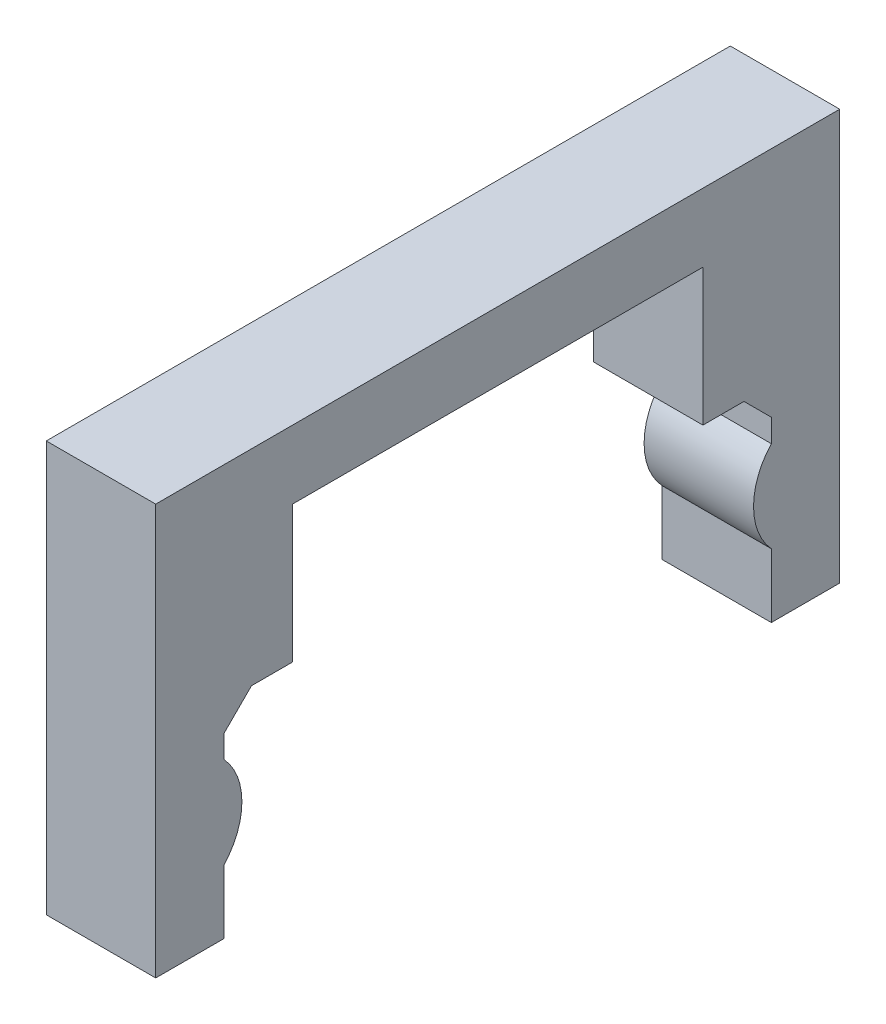
ISO-10303-21;
HEADER;
FILE_DESCRIPTION(('STEP AP214'),'2;1');
FILE_NAME('part.step','',(''),(''),'','','');
FILE_SCHEMA(('AUTOMOTIVE_DESIGN { 1 0 10303 214 1 1 1 1 }'));
ENDSEC;
DATA;
#1=APPLICATION_CONTEXT('core data for automotive mechanical design processes');
#2=APPLICATION_PROTOCOL_DEFINITION('international standard','automotive_design',2000,#1);
#3=PRODUCT_CONTEXT('',#1,'mechanical');
#4=PRODUCT('Part','Part','',(#3));
#5=PRODUCT_RELATED_PRODUCT_CATEGORY('part','',(#4));
#6=PRODUCT_DEFINITION_FORMATION('','',#4);
#7=PRODUCT_DEFINITION_CONTEXT('part definition',#1,'design');
#8=PRODUCT_DEFINITION('design','',#6,#7);
#9=PRODUCT_DEFINITION_SHAPE('','',#8);
#10=(LENGTH_UNIT() NAMED_UNIT(*) SI_UNIT(.MILLI.,.METRE.));
#11=(NAMED_UNIT(*) PLANE_ANGLE_UNIT() SI_UNIT($,.RADIAN.));
#12=(NAMED_UNIT(*) SI_UNIT($,.STERADIAN.) SOLID_ANGLE_UNIT());
#13=UNCERTAINTY_MEASURE_WITH_UNIT(LENGTH_MEASURE(1.E-05),#10,'distance_accuracy_value','');
#14=(GEOMETRIC_REPRESENTATION_CONTEXT(3) GLOBAL_UNCERTAINTY_ASSIGNED_CONTEXT((#13)) GLOBAL_UNIT_ASSIGNED_CONTEXT((#10,
#11,#12)) REPRESENTATION_CONTEXT('',''));
#15=CARTESIAN_POINT('',(0.,0.,0.));
#16=DIRECTION('',(0.,0.,1.));
#17=DIRECTION('',(1.,0.,0.));
#18=AXIS2_PLACEMENT_3D('',#15,#16,#17);
#19=CARTESIAN_POINT('',(10.16,9.94734725305141,44.6955776659082));
#20=DIRECTION('',(0.,0.,-1.));
#21=DIRECTION('',(-1.,0.,0.));
#22=AXIS2_PLACEMENT_3D('',#19,#20,#21);
#23=PLANE('',#22);
#24=DIRECTION('',(0.,-1.,0.));
#25=VECTOR('',#24,1.);
#26=CARTESIAN_POINT('',(10.16,9.94734725305141,44.6955776659082));
#27=LINE('',#26,#25);
#28=CARTESIAN_POINT('',(10.16,7.4073472530514,44.6955776659082));
#29=VERTEX_POINT('',#28);
#30=CARTESIAN_POINT('',(10.16,5.27902286825445,44.6955776659082));
#31=VERTEX_POINT('',#30);
#32=EDGE_CURVE('E156',#29,#31,#27,.T.);
#33=ORIENTED_EDGE('',*,*,#32,.F.);
#34=DIRECTION('',(-1.,0.,0.));
#35=VECTOR('',#34,1.);
#36=CARTESIAN_POINT('',(0.,7.4073472530514,44.6955776659082));
#37=LINE('',#36,#35);
#38=CARTESIAN_POINT('',(0.,7.4073472530514,44.6955776659082));
#39=VERTEX_POINT('',#38);
#40=EDGE_CURVE('E277',#29,#39,#37,.T.);
#41=ORIENTED_EDGE('',*,*,#40,.T.);
#42=DIRECTION('',(0.,-1.,0.));
#43=VECTOR('',#42,1.);
#44=CARTESIAN_POINT('',(0.,9.94734725305141,44.6955776659082));
#45=LINE('',#44,#43);
#46=CARTESIAN_POINT('',(0.,5.27902286825445,44.6955776659082));
#47=VERTEX_POINT('',#46);
#48=EDGE_CURVE('E179',#39,#47,#45,.T.);
#49=ORIENTED_EDGE('',*,*,#48,.T.);
#50=DIRECTION('',(1.,0.,0.));
#51=VECTOR('',#50,1.);
#52=CARTESIAN_POINT('',(0.,5.27902286825445,44.6955776659082));
#53=LINE('',#52,#51);
#54=EDGE_CURVE('E172',#47,#31,#53,.T.);
#55=ORIENTED_EDGE('',*,*,#54,.T.);
#56=EDGE_LOOP('',(#33,#41,#49,#55));
#57=FACE_BOUND('',#56,.T.);
#58=ADVANCED_FACE('F32',(#57),#23,.F.);
#59=CARTESIAN_POINT('',(10.16,-9.1026527469486,95.4955776659082));
#60=DIRECTION('',(0.,0.,1.));
#61=DIRECTION('',(1.,0.,0.));
#62=AXIS2_PLACEMENT_3D('',#59,#60,#61);
#63=PLANE('',#62);
#64=DIRECTION('',(0.,1.,0.));
#65=VECTOR('',#64,1.);
#66=CARTESIAN_POINT('',(0.,-9.1026527469486,95.4955776659082));
#67=LINE('',#66,#65);
#68=CARTESIAN_POINT('',(0.,-9.1026527469486,95.4955776659082));
#69=VERTEX_POINT('',#68);
#70=CARTESIAN_POINT('',(0.,-3.16432836215164,95.4955776659082));
#71=VERTEX_POINT('',#70);
#72=EDGE_CURVE('E223',#69,#71,#67,.T.);
#73=ORIENTED_EDGE('',*,*,#72,.T.);
#74=DIRECTION('',(1.,0.,0.));
#75=VECTOR('',#74,1.);
#76=CARTESIAN_POINT('',(0.,-3.16432836215164,95.4955776659082));
#77=LINE('',#76,#75);
#78=CARTESIAN_POINT('',(10.16,-3.16432836215164,95.4955776659082));
#79=VERTEX_POINT('',#78);
#80=EDGE_CURVE('E190',#71,#79,#77,.T.);
#81=ORIENTED_EDGE('',*,*,#80,.T.);
#82=DIRECTION('',(0.,1.,0.));
#83=VECTOR('',#82,1.);
#84=CARTESIAN_POINT('',(10.16,-9.1026527469486,95.4955776659082));
#85=LINE('',#84,#83);
#86=CARTESIAN_POINT('',(10.16,-9.1026527469486,95.4955776659082));
#87=VERTEX_POINT('',#86);
#88=EDGE_CURVE('E200',#87,#79,#85,.T.);
#89=ORIENTED_EDGE('',*,*,#88,.F.);
#90=DIRECTION('',(-1.,0.,0.));
#91=VECTOR('',#90,1.);
#92=CARTESIAN_POINT('',(10.16,-9.1026527469486,95.4955776659082));
#93=LINE('',#92,#91);
#94=EDGE_CURVE('E266',#87,#69,#93,.T.);
#95=ORIENTED_EDGE('',*,*,#94,.T.);
#96=EDGE_LOOP('',(#73,#81,#89,#95));
#97=FACE_BOUND('',#96,.T.);
#98=ADVANCED_FACE('F310',(#97),#63,.F.);
#99=CARTESIAN_POINT('',(10.16,28.9973472530514,101.845577665908));
#100=DIRECTION('',(0.,0.,-1.));
#101=DIRECTION('',(-1.,0.,0.));
#102=AXIS2_PLACEMENT_3D('',#99,#100,#101);
#103=PLANE('',#102);
#104=DIRECTION('',(-1.,0.,0.));
#105=VECTOR('',#104,1.);
#106=CARTESIAN_POINT('',(10.16,-9.1026527469486,101.845577665908));
#107=LINE('',#106,#105);
#108=CARTESIAN_POINT('',(10.16,-9.1026527469486,101.845577665908));
#109=VERTEX_POINT('',#108);
#110=CARTESIAN_POINT('',(0.,-9.1026527469486,101.845577665908));
#111=VERTEX_POINT('',#110);
#112=EDGE_CURVE('E269',#109,#111,#107,.T.);
#113=ORIENTED_EDGE('',*,*,#112,.F.);
#114=DIRECTION('',(0.,-1.,0.));
#115=VECTOR('',#114,1.);
#116=CARTESIAN_POINT('',(10.16,28.9973472530514,101.845577665908));
#117=LINE('',#116,#115);
#118=CARTESIAN_POINT('',(10.16,28.9973472530514,101.845577665908));
#119=VERTEX_POINT('',#118);
#120=EDGE_CURVE('E194',#119,#109,#117,.T.);
#121=ORIENTED_EDGE('',*,*,#120,.F.);
#122=DIRECTION('',(-1.,0.,0.));
#123=VECTOR('',#122,1.);
#124=CARTESIAN_POINT('',(10.16,28.9973472530514,101.845577665908));
#125=LINE('',#124,#123);
#126=CARTESIAN_POINT('',(0.,28.9973472530514,101.845577665908));
#127=VERTEX_POINT('',#126);
#128=EDGE_CURVE('E218',#119,#127,#125,.T.);
#129=ORIENTED_EDGE('',*,*,#128,.T.);
#130=DIRECTION('',(0.,-1.,0.));
#131=VECTOR('',#130,1.);
#132=CARTESIAN_POINT('',(0.,28.9973472530514,101.845577665908));
#133=LINE('',#132,#131);
#134=EDGE_CURVE('E193',#127,#111,#133,.T.);
#135=ORIENTED_EDGE('',*,*,#134,.T.);
#136=EDGE_LOOP('',(#113,#121,#129,#135));
#137=FACE_BOUND('',#136,.T.);
#138=ADVANCED_FACE('F321',(#137),#103,.F.);
#139=CARTESIAN_POINT('',(10.16,-9.1026527469486,101.845577665908));
#140=DIRECTION('',(0.,1.,0.));
#141=DIRECTION('',(0.,0.,1.));
#142=AXIS2_PLACEMENT_3D('',#139,#140,#141);
#143=PLANE('',#142);
#144=DIRECTION('',(0.,0.,-1.));
#145=VECTOR('',#144,1.);
#146=CARTESIAN_POINT('',(0.,-9.1026527469486,101.845577665908));
#147=LINE('',#146,#145);
#148=EDGE_CURVE('E220',#111,#69,#147,.T.);
#149=ORIENTED_EDGE('',*,*,#148,.T.);
#150=ORIENTED_EDGE('',*,*,#94,.F.);
#151=DIRECTION('',(0.,0.,-1.));
#152=VECTOR('',#151,1.);
#153=CARTESIAN_POINT('',(10.16,-9.1026527469486,101.845577665908));
#154=LINE('',#153,#152);
#155=EDGE_CURVE('E196',#109,#87,#154,.T.);
#156=ORIENTED_EDGE('',*,*,#155,.F.);
#157=ORIENTED_EDGE('',*,*,#112,.T.);
#158=EDGE_LOOP('',(#149,#150,#156,#157));
#159=FACE_BOUND('',#158,.T.);
#160=ADVANCED_FACE('F315',(#159),#143,.F.);
#161=CARTESIAN_POINT('',(0.,5.27902286825446,95.4955776659082));
#162=VERTEX_POINT('',#161);
#163=CARTESIAN_POINT('',(0.,7.4073472530514,95.4955776659082));
#164=VERTEX_POINT('',#163);
#165=EDGE_CURVE('E222',#162,#164,#67,.T.);
#166=ORIENTED_EDGE('',*,*,#165,.T.);
#167=DIRECTION('',(1.,0.,0.));
#168=VECTOR('',#167,1.);
#169=CARTESIAN_POINT('',(10.16,7.4073472530514,95.4955776659082));
#170=LINE('',#169,#168);
#171=CARTESIAN_POINT('',(10.16,7.4073472530514,95.4955776659082));
#172=VERTEX_POINT('',#171);
#173=EDGE_CURVE('E275',#164,#172,#170,.T.);
#174=ORIENTED_EDGE('',*,*,#173,.T.);
#175=CARTESIAN_POINT('',(10.16,5.27902286825446,95.4955776659082));
#176=VERTEX_POINT('',#175);
#177=EDGE_CURVE('E199',#176,#172,#85,.T.);
#178=ORIENTED_EDGE('',*,*,#177,.F.);
#179=DIRECTION('',(1.,0.,0.));
#180=VECTOR('',#179,1.);
#181=CARTESIAN_POINT('',(0.,5.27902286825446,95.4955776659082));
#182=LINE('',#181,#180);
#183=EDGE_CURVE('E186',#176,#162,#182,.F.);
#184=ORIENTED_EDGE('',*,*,#183,.T.);
#185=EDGE_LOOP('',(#166,#174,#178,#184));
#186=FACE_BOUND('',#185,.T.);
#187=ADVANCED_FACE('F303',(#186),#63,.F.);
#188=CARTESIAN_POINT('',(10.16,9.94734725305141,95.4955776659082));
#189=DIRECTION('',(0.,1.,0.));
#190=DIRECTION('',(0.,0.,1.));
#191=AXIS2_PLACEMENT_3D('',#188,#189,#190);
#192=PLANE('',#191);
#193=DIRECTION('',(0.,0.,-1.));
#194=VECTOR('',#193,1.);
#195=CARTESIAN_POINT('',(10.16,9.94734725305141,95.4955776659082));
#196=LINE('',#195,#194);
#197=CARTESIAN_POINT('',(10.16,9.94734725305141,92.9555776659082));
#198=VERTEX_POINT('',#197);
#199=CARTESIAN_POINT('',(10.16,9.94734725305141,89.1455776659082));
#200=VERTEX_POINT('',#199);
#201=EDGE_CURVE('E203',#198,#200,#196,.T.);
#202=ORIENTED_EDGE('',*,*,#201,.F.);
#203=DIRECTION('',(-1.,0.,0.));
#204=VECTOR('',#203,1.);
#205=CARTESIAN_POINT('',(0.,9.94734725305141,92.9555776659082));
#206=LINE('',#205,#204);
#207=CARTESIAN_POINT('',(0.,9.94734725305141,92.9555776659082));
#208=VERTEX_POINT('',#207);
#209=EDGE_CURVE('E272',#198,#208,#206,.T.);
#210=ORIENTED_EDGE('',*,*,#209,.T.);
#211=DIRECTION('',(0.,0.,-1.));
#212=VECTOR('',#211,1.);
#213=CARTESIAN_POINT('',(0.,9.94734725305141,95.4955776659082));
#214=LINE('',#213,#212);
#215=CARTESIAN_POINT('',(0.,9.94734725305141,89.1455776659082));
#216=VERTEX_POINT('',#215);
#217=EDGE_CURVE('E226',#208,#216,#214,.T.);
#218=ORIENTED_EDGE('',*,*,#217,.T.);
#219=DIRECTION('',(-1.,0.,0.));
#220=VECTOR('',#219,1.);
#221=CARTESIAN_POINT('',(10.16,9.94734725305141,89.1455776659082));
#222=LINE('',#221,#220);
#223=EDGE_CURVE('E263',#200,#216,#222,.T.);
#224=ORIENTED_EDGE('',*,*,#223,.F.);
#225=EDGE_LOOP('',(#202,#210,#218,#224));
#226=FACE_BOUND('',#225,.T.);
#227=ADVANCED_FACE('F292',(#226),#192,.F.);
#228=CARTESIAN_POINT('',(10.16,9.94734725305141,89.1455776659082));
#229=DIRECTION('',(0.,0.,1.));
#230=DIRECTION('',(1.,0.,0.));
#231=AXIS2_PLACEMENT_3D('',#228,#229,#230);
#232=PLANE('',#231);
#233=DIRECTION('',(0.,1.,0.));
#234=VECTOR('',#233,1.);
#235=CARTESIAN_POINT('',(0.,9.94734725305141,89.1455776659082));
#236=LINE('',#235,#234);
#237=CARTESIAN_POINT('',(0.,22.6473472530514,89.1455776659082));
#238=VERTEX_POINT('',#237);
#239=EDGE_CURVE('E228',#216,#238,#236,.T.);
#240=ORIENTED_EDGE('',*,*,#239,.T.);
#241=DIRECTION('',(-1.,0.,0.));
#242=VECTOR('',#241,1.);
#243=CARTESIAN_POINT('',(10.16,22.6473472530514,89.1455776659082));
#244=LINE('',#243,#242);
#245=CARTESIAN_POINT('',(10.16,22.6473472530514,89.1455776659082));
#246=VERTEX_POINT('',#245);
#247=EDGE_CURVE('E260',#246,#238,#244,.T.);
#248=ORIENTED_EDGE('',*,*,#247,.F.);
#249=DIRECTION('',(0.,1.,0.));
#250=VECTOR('',#249,1.);
#251=CARTESIAN_POINT('',(10.16,9.94734725305141,89.1455776659082));
#252=LINE('',#251,#250);
#253=EDGE_CURVE('E205',#200,#246,#252,.T.);
#254=ORIENTED_EDGE('',*,*,#253,.F.);
#255=ORIENTED_EDGE('',*,*,#223,.T.);
#256=EDGE_LOOP('',(#240,#248,#254,#255));
#257=FACE_BOUND('',#256,.T.);
#258=ADVANCED_FACE('F365',(#257),#232,.F.);
#259=CARTESIAN_POINT('',(10.16,22.6473472530514,89.1455776659082));
#260=DIRECTION('',(0.,1.,0.));
#261=DIRECTION('',(0.,0.,1.));
#262=AXIS2_PLACEMENT_3D('',#259,#260,#261);
#263=PLANE('',#262);
#264=DIRECTION('',(0.,0.,-1.));
#265=VECTOR('',#264,1.);
#266=CARTESIAN_POINT('',(0.,22.6473472530514,89.1455776659082));
#267=LINE('',#266,#265);
#268=CARTESIAN_POINT('',(0.,22.6473472530514,51.0455776659082));
#269=VERTEX_POINT('',#268);
#270=EDGE_CURVE('E230',#238,#269,#267,.T.);
#271=ORIENTED_EDGE('',*,*,#270,.T.);
#272=DIRECTION('',(-1.,0.,0.));
#273=VECTOR('',#272,1.);
#274=CARTESIAN_POINT('',(10.16,22.6473472530514,51.0455776659082));
#275=LINE('',#274,#273);
#276=CARTESIAN_POINT('',(10.16,22.6473472530514,51.0455776659082));
#277=VERTEX_POINT('',#276);
#278=EDGE_CURVE('E257',#277,#269,#275,.T.);
#279=ORIENTED_EDGE('',*,*,#278,.F.);
#280=DIRECTION('',(0.,0.,-1.));
#281=VECTOR('',#280,1.);
#282=CARTESIAN_POINT('',(10.16,22.6473472530514,89.1455776659082));
#283=LINE('',#282,#281);
#284=EDGE_CURVE('E207',#246,#277,#283,.T.);
#285=ORIENTED_EDGE('',*,*,#284,.F.);
#286=ORIENTED_EDGE('',*,*,#247,.T.);
#287=EDGE_LOOP('',(#271,#279,#285,#286));
#288=FACE_BOUND('',#287,.T.);
#289=ADVANCED_FACE('F447',(#288),#263,.F.);
#290=CARTESIAN_POINT('',(10.16,22.6473472530514,51.0455776659082));
#291=DIRECTION('',(0.,0.,-1.));
#292=DIRECTION('',(-1.,0.,0.));
#293=AXIS2_PLACEMENT_3D('',#290,#291,#292);
#294=PLANE('',#293);
#295=DIRECTION('',(0.,-1.,0.));
#296=VECTOR('',#295,1.);
#297=CARTESIAN_POINT('',(0.,22.6473472530514,51.0455776659082));
#298=LINE('',#297,#296);
#299=CARTESIAN_POINT('',(0.,9.94734725305141,51.0455776659082));
#300=VERTEX_POINT('',#299);
#301=EDGE_CURVE('E232',#269,#300,#298,.T.);
#302=ORIENTED_EDGE('',*,*,#301,.T.);
#303=DIRECTION('',(-1.,0.,0.));
#304=VECTOR('',#303,1.);
#305=CARTESIAN_POINT('',(10.16,9.94734725305141,51.0455776659082));
#306=LINE('',#305,#304);
#307=CARTESIAN_POINT('',(10.16,9.94734725305141,51.0455776659082));
#308=VERTEX_POINT('',#307);
#309=EDGE_CURVE('E254',#308,#300,#306,.T.);
#310=ORIENTED_EDGE('',*,*,#309,.F.);
#311=DIRECTION('',(0.,-1.,0.));
#312=VECTOR('',#311,1.);
#313=CARTESIAN_POINT('',(10.16,22.6473472530514,51.0455776659082));
#314=LINE('',#313,#312);
#315=EDGE_CURVE('E209',#277,#308,#314,.T.);
#316=ORIENTED_EDGE('',*,*,#315,.F.);
#317=ORIENTED_EDGE('',*,*,#278,.T.);
#318=EDGE_LOOP('',(#302,#310,#316,#317));
#319=FACE_BOUND('',#318,.T.);
#320=ADVANCED_FACE('F347',(#319),#294,.F.);
#321=CARTESIAN_POINT('',(10.16,9.94734725305141,51.0455776659082));
#322=DIRECTION('',(0.,1.,0.));
#323=DIRECTION('',(0.,0.,1.));
#324=AXIS2_PLACEMENT_3D('',#321,#322,#323);
#325=PLANE('',#324);
#326=DIRECTION('',(0.,0.,-1.));
#327=VECTOR('',#326,1.);
#328=CARTESIAN_POINT('',(0.,9.94734725305141,51.0455776659082));
#329=LINE('',#328,#327);
#330=CARTESIAN_POINT('',(0.,9.94734725305141,47.2355776659082));
#331=VERTEX_POINT('',#330);
#332=EDGE_CURVE('E234',#300,#331,#329,.T.);
#333=ORIENTED_EDGE('',*,*,#332,.T.);
#334=DIRECTION('',(1.,0.,0.));
#335=VECTOR('',#334,1.);
#336=CARTESIAN_POINT('',(10.16,9.94734725305141,47.2355776659082));
#337=LINE('',#336,#335);
#338=CARTESIAN_POINT('',(10.16,9.94734725305141,47.2355776659082));
#339=VERTEX_POINT('',#338);
#340=EDGE_CURVE('E47',#331,#339,#337,.T.);
#341=ORIENTED_EDGE('',*,*,#340,.T.);
#342=DIRECTION('',(0.,0.,-1.));
#343=VECTOR('',#342,1.);
#344=CARTESIAN_POINT('',(10.16,9.94734725305141,51.0455776659082));
#345=LINE('',#344,#343);
#346=EDGE_CURVE('E211',#308,#339,#345,.T.);
#347=ORIENTED_EDGE('',*,*,#346,.F.);
#348=ORIENTED_EDGE('',*,*,#309,.T.);
#349=EDGE_LOOP('',(#333,#341,#347,#348));
#350=FACE_BOUND('',#349,.T.);
#351=ADVANCED_FACE('F340',(#350),#325,.F.);
#352=CARTESIAN_POINT('',(10.16,-3.16432836215163,44.6955776659082));
#353=VERTEX_POINT('',#352);
#354=CARTESIAN_POINT('',(10.16,-9.1026527469486,44.6955776659082));
#355=VERTEX_POINT('',#354);
#356=EDGE_CURVE('E167',#353,#355,#27,.T.);
#357=ORIENTED_EDGE('',*,*,#356,.F.);
#358=DIRECTION('',(1.,0.,0.));
#359=VECTOR('',#358,1.);
#360=CARTESIAN_POINT('',(0.,-3.16432836215163,44.6955776659082));
#361=LINE('',#360,#359);
#362=CARTESIAN_POINT('',(0.,-3.16432836215164,44.6955776659082));
#363=VERTEX_POINT('',#362);
#364=EDGE_CURVE('E175',#353,#363,#361,.F.);
#365=ORIENTED_EDGE('',*,*,#364,.T.);
#366=CARTESIAN_POINT('',(0.,-9.1026527469486,44.6955776659082));
#367=VERTEX_POINT('',#366);
#368=EDGE_CURVE('E236',#363,#367,#45,.T.);
#369=ORIENTED_EDGE('',*,*,#368,.T.);
#370=DIRECTION('',(-1.,0.,0.));
#371=VECTOR('',#370,1.);
#372=CARTESIAN_POINT('',(10.16,-9.1026527469486,44.6955776659082));
#373=LINE('',#372,#371);
#374=EDGE_CURVE('E251',#355,#367,#373,.T.);
#375=ORIENTED_EDGE('',*,*,#374,.F.);
#376=EDGE_LOOP('',(#357,#365,#369,#375));
#377=FACE_BOUND('',#376,.T.);
#378=ADVANCED_FACE('F338',(#377),#23,.F.);
#379=CARTESIAN_POINT('',(10.16,-9.1026527469486,44.6955776659082));
#380=DIRECTION('',(0.,1.,0.));
#381=DIRECTION('',(0.,0.,1.));
#382=AXIS2_PLACEMENT_3D('',#379,#380,#381);
#383=PLANE('',#382);
#384=DIRECTION('',(0.,0.,-1.));
#385=VECTOR('',#384,1.);
#386=CARTESIAN_POINT('',(0.,-9.1026527469486,44.6955776659082));
#387=LINE('',#386,#385);
#388=CARTESIAN_POINT('',(0.,-9.1026527469486,38.3455776659082));
#389=VERTEX_POINT('',#388);
#390=EDGE_CURVE('E238',#367,#389,#387,.T.);
#391=ORIENTED_EDGE('',*,*,#390,.T.);
#392=DIRECTION('',(-1.,0.,0.));
#393=VECTOR('',#392,1.);
#394=CARTESIAN_POINT('',(10.16,-9.1026527469486,38.3455776659082));
#395=LINE('',#394,#393);
#396=CARTESIAN_POINT('',(10.16,-9.1026527469486,38.3455776659082));
#397=VERTEX_POINT('',#396);
#398=EDGE_CURVE('E248',#397,#389,#395,.T.);
#399=ORIENTED_EDGE('',*,*,#398,.F.);
#400=DIRECTION('',(0.,0.,-1.));
#401=VECTOR('',#400,1.);
#402=CARTESIAN_POINT('',(10.16,-9.1026527469486,44.6955776659082));
#403=LINE('',#402,#401);
#404=EDGE_CURVE('E166',#355,#397,#403,.T.);
#405=ORIENTED_EDGE('',*,*,#404,.F.);
#406=ORIENTED_EDGE('',*,*,#374,.T.);
#407=EDGE_LOOP('',(#391,#399,#405,#406));
#408=FACE_BOUND('',#407,.T.);
#409=ADVANCED_FACE('F334',(#408),#383,.F.);
#410=CARTESIAN_POINT('',(10.16,-9.1026527469486,38.3455776659082));
#411=DIRECTION('',(0.,0.,1.));
#412=DIRECTION('',(1.,0.,0.));
#413=AXIS2_PLACEMENT_3D('',#410,#411,#412);
#414=PLANE('',#413);
#415=DIRECTION('',(-1.,0.,0.));
#416=VECTOR('',#415,1.);
#417=CARTESIAN_POINT('',(10.16,28.9973472530514,38.3455776659082));
#418=LINE('',#417,#416);
#419=CARTESIAN_POINT('',(10.16,28.9973472530514,38.3455776659082));
#420=VERTEX_POINT('',#419);
#421=CARTESIAN_POINT('',(0.,28.9973472530514,38.3455776659082));
#422=VERTEX_POINT('',#421);
#423=EDGE_CURVE('E245',#420,#422,#418,.T.);
#424=ORIENTED_EDGE('',*,*,#423,.F.);
#425=DIRECTION('',(0.,1.,0.));
#426=VECTOR('',#425,1.);
#427=CARTESIAN_POINT('',(10.16,-9.1026527469486,38.3455776659082));
#428=LINE('',#427,#426);
#429=EDGE_CURVE('E214',#397,#420,#428,.T.);
#430=ORIENTED_EDGE('',*,*,#429,.F.);
#431=ORIENTED_EDGE('',*,*,#398,.T.);
#432=DIRECTION('',(0.,1.,0.));
#433=VECTOR('',#432,1.);
#434=CARTESIAN_POINT('',(0.,-9.1026527469486,38.3455776659082));
#435=LINE('',#434,#433);
#436=EDGE_CURVE('E240',#389,#422,#435,.T.);
#437=ORIENTED_EDGE('',*,*,#436,.T.);
#438=EDGE_LOOP('',(#424,#430,#431,#437));
#439=FACE_BOUND('',#438,.T.);
#440=ADVANCED_FACE('F330',(#439),#414,.F.);
#441=CARTESIAN_POINT('',(10.16,28.9973472530514,38.3455776659082));
#442=DIRECTION('',(0.,-1.,0.));
#443=DIRECTION('',(0.,0.,-1.));
#444=AXIS2_PLACEMENT_3D('',#441,#442,#443);
#445=PLANE('',#444);
#446=DIRECTION('',(0.,0.,1.));
#447=VECTOR('',#446,1.);
#448=CARTESIAN_POINT('',(0.,28.9973472530514,38.3455776659082));
#449=LINE('',#448,#447);
#450=EDGE_CURVE('E197',#422,#127,#449,.T.);
#451=ORIENTED_EDGE('',*,*,#450,.T.);
#452=ORIENTED_EDGE('',*,*,#128,.F.);
#453=DIRECTION('',(0.,0.,1.));
#454=VECTOR('',#453,1.);
#455=CARTESIAN_POINT('',(10.16,28.9973472530514,38.3455776659082));
#456=LINE('',#455,#454);
#457=EDGE_CURVE('E216',#420,#119,#456,.T.);
#458=ORIENTED_EDGE('',*,*,#457,.F.);
#459=ORIENTED_EDGE('',*,*,#423,.T.);
#460=EDGE_LOOP('',(#451,#452,#458,#459));
#461=FACE_BOUND('',#460,.T.);
#462=ADVANCED_FACE('F326',(#461),#445,.F.);
#463=CARTESIAN_POINT('',(10.16,-9.1026527469486,101.845577665908));
#464=DIRECTION('',(1.,0.,0.));
#465=DIRECTION('',(0.,0.,-1.));
#466=AXIS2_PLACEMENT_3D('',#463,#464,#465);
#467=PLANE('',#466);
#468=ORIENTED_EDGE('',*,*,#429,.T.);
#469=ORIENTED_EDGE('',*,*,#457,.T.);
#470=ORIENTED_EDGE('',*,*,#120,.T.);
#471=ORIENTED_EDGE('',*,*,#155,.T.);
#472=ORIENTED_EDGE('',*,*,#88,.T.);
#473=CARTESIAN_POINT('',(10.16,1.05734725305141,100.067577665908));
#474=DIRECTION('',(1.,0.,0.));
#475=DIRECTION('',(0.,0.,-1.));
#476=AXIS2_PLACEMENT_3D('',#473,#474,#475);
#477=CIRCLE('',#476,6.223);
#478=EDGE_CURVE('E180',#79,#176,#477,.T.);
#479=ORIENTED_EDGE('',*,*,#478,.T.);
#480=ORIENTED_EDGE('',*,*,#177,.T.);
#481=DIRECTION('',(0.,-0.707106781186543,0.707106781186552));
#482=VECTOR('',#481,1.);
#483=CARTESIAN_POINT('',(10.16,9.94734725305141,92.9555776659082));
#484=LINE('',#483,#482);
#485=EDGE_CURVE('E282',#172,#198,#484,.F.);
#486=ORIENTED_EDGE('',*,*,#485,.T.);
#487=ORIENTED_EDGE('',*,*,#201,.T.);
#488=ORIENTED_EDGE('',*,*,#253,.T.);
#489=ORIENTED_EDGE('',*,*,#284,.T.);
#490=ORIENTED_EDGE('',*,*,#315,.T.);
#491=ORIENTED_EDGE('',*,*,#346,.T.);
#492=DIRECTION('',(0.,0.707106781186551,0.707106781186544));
#493=VECTOR('',#492,1.);
#494=CARTESIAN_POINT('',(10.16,7.4073472530514,44.6955776659082));
#495=LINE('',#494,#493);
#496=EDGE_CURVE('E11',#339,#29,#495,.F.);
#497=ORIENTED_EDGE('',*,*,#496,.T.);
#498=ORIENTED_EDGE('',*,*,#32,.T.);
#499=CARTESIAN_POINT('',(10.16,1.05734725305141,40.1235776659082));
#500=DIRECTION('',(1.,0.,0.));
#501=DIRECTION('',(0.,0.,-1.));
#502=AXIS2_PLACEMENT_3D('',#499,#500,#501);
#503=CIRCLE('',#502,6.223);
#504=EDGE_CURVE('E159',#31,#353,#503,.T.);
#505=ORIENTED_EDGE('',*,*,#504,.T.);
#506=ORIENTED_EDGE('',*,*,#356,.T.);
#507=ORIENTED_EDGE('',*,*,#404,.T.);
#508=EDGE_LOOP('',(#468,#469,#470,#471,#472,#479,#480,#486,#487,#488,#489,#490,#491,#497,#498,
#505,#506,#507));
#509=FACE_BOUND('',#508,.T.);
#510=ADVANCED_FACE('F158',(#509),#467,.T.);
#511=CARTESIAN_POINT('',(0.,-9.1026527469486,101.845577665908));
#512=DIRECTION('',(1.,0.,0.));
#513=DIRECTION('',(0.,0.,-1.));
#514=AXIS2_PLACEMENT_3D('',#511,#512,#513);
#515=PLANE('',#514);
#516=ORIENTED_EDGE('',*,*,#368,.F.);
#517=CARTESIAN_POINT('',(0.,1.05734725305141,40.1235776659082));
#518=DIRECTION('',(1.,0.,0.));
#519=DIRECTION('',(0.,0.,-1.));
#520=AXIS2_PLACEMENT_3D('',#517,#518,#519);
#521=CIRCLE('',#520,6.223);
#522=EDGE_CURVE('E177',#47,#363,#521,.T.);
#523=ORIENTED_EDGE('',*,*,#522,.F.);
#524=ORIENTED_EDGE('',*,*,#48,.F.);
#525=DIRECTION('',(0.,-0.707106781186551,-0.707106781186544));
#526=VECTOR('',#525,1.);
#527=CARTESIAN_POINT('',(0.,27.7273472530513,65.0155776659079));
#528=LINE('',#527,#526);
#529=EDGE_CURVE('E40',#39,#331,#528,.F.);
#530=ORIENTED_EDGE('',*,*,#529,.T.);
#531=ORIENTED_EDGE('',*,*,#332,.F.);
#532=ORIENTED_EDGE('',*,*,#301,.F.);
#533=ORIENTED_EDGE('',*,*,#270,.F.);
#534=ORIENTED_EDGE('',*,*,#239,.F.);
#535=ORIENTED_EDGE('',*,*,#217,.F.);
#536=DIRECTION('',(0.,0.707106781186543,-0.707106781186552));
#537=VECTOR('',#536,1.);
#538=CARTESIAN_POINT('',(0.,-4.02265274694849,106.925577665908));
#539=LINE('',#538,#537);
#540=EDGE_CURVE('E280',#208,#164,#539,.F.);
#541=ORIENTED_EDGE('',*,*,#540,.T.);
#542=ORIENTED_EDGE('',*,*,#165,.F.);
#543=CARTESIAN_POINT('',(0.,1.05734725305141,100.067577665908));
#544=DIRECTION('',(1.,0.,0.));
#545=DIRECTION('',(0.,0.,-1.));
#546=AXIS2_PLACEMENT_3D('',#543,#544,#545);
#547=CIRCLE('',#546,6.223);
#548=EDGE_CURVE('E182',#71,#162,#547,.T.);
#549=ORIENTED_EDGE('',*,*,#548,.F.);
#550=ORIENTED_EDGE('',*,*,#72,.F.);
#551=ORIENTED_EDGE('',*,*,#148,.F.);
#552=ORIENTED_EDGE('',*,*,#134,.F.);
#553=ORIENTED_EDGE('',*,*,#450,.F.);
#554=ORIENTED_EDGE('',*,*,#436,.F.);
#555=ORIENTED_EDGE('',*,*,#390,.F.);
#556=EDGE_LOOP('',(#516,#523,#524,#530,#531,#532,#533,#534,#535,#541,#542,#549,#550,#551,#552,
#553,#554,#555));
#557=FACE_BOUND('',#556,.T.);
#558=ADVANCED_FACE('F299',(#557),#515,.F.);
#559=CARTESIAN_POINT('',(0.,1.05734725305141,100.067577665908));
#560=DIRECTION('',(1.,0.,0.));
#561=DIRECTION('',(0.,0.,-1.));
#562=AXIS2_PLACEMENT_3D('',#559,#560,#561);
#563=CYLINDRICAL_SURFACE('',#562,6.223);
#564=ORIENTED_EDGE('',*,*,#80,.F.);
#565=ORIENTED_EDGE('',*,*,#548,.T.);
#566=ORIENTED_EDGE('',*,*,#183,.F.);
#567=ORIENTED_EDGE('',*,*,#478,.F.);
#568=EDGE_LOOP('',(#564,#565,#566,#567));
#569=FACE_BOUND('',#568,.T.);
#570=ADVANCED_FACE('F306',(#569),#563,.T.);
#571=CARTESIAN_POINT('',(0.,1.05734725305141,40.1235776659082));
#572=DIRECTION('',(1.,0.,0.));
#573=DIRECTION('',(0.,0.,-1.));
#574=AXIS2_PLACEMENT_3D('',#571,#572,#573);
#575=CYLINDRICAL_SURFACE('',#574,6.223);
#576=ORIENTED_EDGE('',*,*,#54,.F.);
#577=ORIENTED_EDGE('',*,*,#522,.T.);
#578=ORIENTED_EDGE('',*,*,#364,.F.);
#579=ORIENTED_EDGE('',*,*,#504,.F.);
#580=EDGE_LOOP('',(#576,#577,#578,#579));
#581=FACE_BOUND('',#580,.T.);
#582=ADVANCED_FACE('F171',(#581),#575,.T.);
#583=CARTESIAN_POINT('',(10.16,9.94734725305141,92.9555776659082));
#584=DIRECTION('',(0.,-0.707106781186552,-0.707106781186543));
#585=DIRECTION('',(0.,0.707106781186543,-0.707106781186552));
#586=AXIS2_PLACEMENT_3D('',#583,#584,#585);
#587=PLANE('',#586);
#588=ORIENTED_EDGE('',*,*,#485,.F.);
#589=ORIENTED_EDGE('',*,*,#173,.F.);
#590=ORIENTED_EDGE('',*,*,#540,.F.);
#591=ORIENTED_EDGE('',*,*,#209,.F.);
#592=EDGE_LOOP('',(#588,#589,#590,#591));
#593=FACE_BOUND('',#592,.T.);
#594=ADVANCED_FACE('F295',(#593),#587,.T.);
#595=CARTESIAN_POINT('',(10.16,7.4073472530514,44.6955776659082));
#596=DIRECTION('',(0.,-0.707106781186544,0.707106781186551));
#597=DIRECTION('',(0.,-0.707106781186551,-0.707106781186544));
#598=AXIS2_PLACEMENT_3D('',#595,#596,#597);
#599=PLANE('',#598);
#600=ORIENTED_EDGE('',*,*,#496,.F.);
#601=ORIENTED_EDGE('',*,*,#340,.F.);
#602=ORIENTED_EDGE('',*,*,#529,.F.);
#603=ORIENTED_EDGE('',*,*,#40,.F.);
#604=EDGE_LOOP('',(#600,#601,#602,#603));
#605=FACE_BOUND('',#604,.T.);
#606=ADVANCED_FACE('F34',(#605),#599,.T.);
#607=CLOSED_SHELL('',(#58,#98,#138,#160,#187,#227,#258,#289,#320,#351,#378,#409,#440,#462,#510,
#558,#570,#582,#594,#606));
#608=MANIFOLD_SOLID_BREP('B2',#607);
#609=ADVANCED_BREP_SHAPE_REPRESENTATION('',(#18,#608),#14);
#610=SHAPE_DEFINITION_REPRESENTATION(#9,#609);
ENDSEC;
END-ISO-10303-21;
